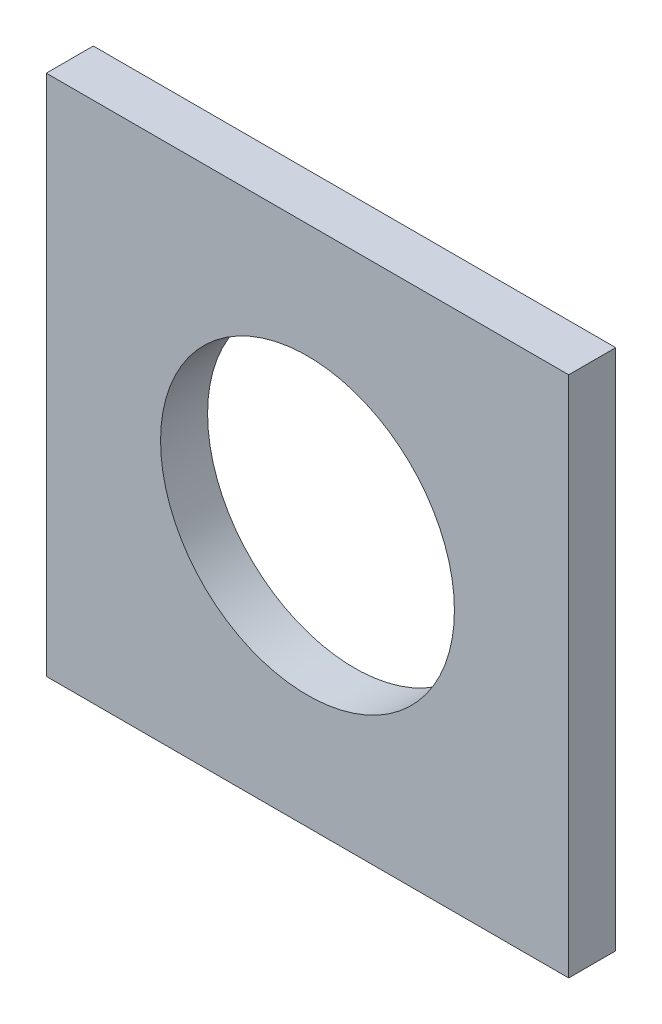
ISO-10303-21;
HEADER;
FILE_DESCRIPTION(('STEP AP214'),'2;1');
FILE_NAME('part.step','',(''),(''),'','','');
FILE_SCHEMA(('AUTOMOTIVE_DESIGN { 1 0 10303 214 1 1 1 1 }'));
ENDSEC;
DATA;
#1=APPLICATION_CONTEXT('core data for automotive mechanical design processes');
#2=APPLICATION_PROTOCOL_DEFINITION('international standard','automotive_design',2000,#1);
#3=PRODUCT_CONTEXT('',#1,'mechanical');
#4=PRODUCT('Part','Part','',(#3));
#5=PRODUCT_RELATED_PRODUCT_CATEGORY('part','',(#4));
#6=PRODUCT_DEFINITION_FORMATION('','',#4);
#7=PRODUCT_DEFINITION_CONTEXT('part definition',#1,'design');
#8=PRODUCT_DEFINITION('design','',#6,#7);
#9=PRODUCT_DEFINITION_SHAPE('','',#8);
#10=(LENGTH_UNIT() NAMED_UNIT(*) SI_UNIT(.MILLI.,.METRE.));
#11=(NAMED_UNIT(*) PLANE_ANGLE_UNIT() SI_UNIT($,.RADIAN.));
#12=(NAMED_UNIT(*) SI_UNIT($,.STERADIAN.) SOLID_ANGLE_UNIT());
#13=UNCERTAINTY_MEASURE_WITH_UNIT(LENGTH_MEASURE(1.E-05),#10,'distance_accuracy_value','');
#14=(GEOMETRIC_REPRESENTATION_CONTEXT(3) GLOBAL_UNCERTAINTY_ASSIGNED_CONTEXT((#13)) GLOBAL_UNIT_ASSIGNED_CONTEXT((#10,
#11,#12)) REPRESENTATION_CONTEXT('',''));
#15=CARTESIAN_POINT('',(0.,0.,0.));
#16=DIRECTION('',(0.,0.,1.));
#17=DIRECTION('',(1.,0.,0.));
#18=AXIS2_PLACEMENT_3D('',#15,#16,#17);
#19=CARTESIAN_POINT('',(-18.8976,19.0330666666667,4.572));
#20=DIRECTION('',(1.,0.,0.));
#21=DIRECTION('',(0.,1.,0.));
#22=AXIS2_PLACEMENT_3D('',#19,#20,#21);
#23=PLANE('',#22);
#24=DIRECTION('',(0.,-1.,0.));
#25=VECTOR('',#24,1.);
#26=CARTESIAN_POINT('',(-18.8976,19.0330666666667,0.));
#27=LINE('',#26,#25);
#28=CARTESIAN_POINT('',(-18.8976,19.0330666666667,0.));
#29=VERTEX_POINT('',#28);
#30=CARTESIAN_POINT('',(-18.8976,-31.7669333333333,0.));
#31=VERTEX_POINT('',#30);
#32=EDGE_CURVE('E96',#29,#31,#27,.T.);
#33=ORIENTED_EDGE('',*,*,#32,.T.);
#34=DIRECTION('',(0.,0.,-1.));
#35=VECTOR('',#34,1.);
#36=CARTESIAN_POINT('',(-18.8976,-31.7669333333333,4.572));
#37=LINE('',#36,#35);
#38=CARTESIAN_POINT('',(-18.8976,-31.7669333333333,4.572));
#39=VERTEX_POINT('',#38);
#40=EDGE_CURVE('E11',#39,#31,#37,.T.);
#41=ORIENTED_EDGE('',*,*,#40,.F.);
#42=DIRECTION('',(0.,-1.,0.));
#43=VECTOR('',#42,1.);
#44=CARTESIAN_POINT('',(-18.8976,19.0330666666667,4.572));
#45=LINE('',#44,#43);
#46=CARTESIAN_POINT('',(-18.8976,19.0330666666667,4.572));
#47=VERTEX_POINT('',#46);
#48=EDGE_CURVE('E84',#47,#39,#45,.T.);
#49=ORIENTED_EDGE('',*,*,#48,.F.);
#50=DIRECTION('',(0.,0.,-1.));
#51=VECTOR('',#50,1.);
#52=CARTESIAN_POINT('',(-18.8976,19.0330666666667,4.572));
#53=LINE('',#52,#51);
#54=EDGE_CURVE('E92',#47,#29,#53,.T.);
#55=ORIENTED_EDGE('',*,*,#54,.T.);
#56=EDGE_LOOP('',(#33,#41,#49,#55));
#57=FACE_BOUND('',#56,.T.);
#58=ADVANCED_FACE('F33',(#57),#23,.F.);
#59=CARTESIAN_POINT('',(-18.8976,-31.7669333333333,4.572));
#60=DIRECTION('',(0.,1.,0.));
#61=DIRECTION('',(0.,0.,1.));
#62=AXIS2_PLACEMENT_3D('',#59,#60,#61);
#63=PLANE('',#62);
#64=DIRECTION('',(1.,0.,0.));
#65=VECTOR('',#64,1.);
#66=CARTESIAN_POINT('',(-18.8976,-31.7669333333333,0.));
#67=LINE('',#66,#65);
#68=CARTESIAN_POINT('',(31.9024,-31.7669333333333,0.));
#69=VERTEX_POINT('',#68);
#70=EDGE_CURVE('E88',#31,#69,#67,.T.);
#71=ORIENTED_EDGE('',*,*,#70,.T.);
#72=DIRECTION('',(0.,0.,-1.));
#73=VECTOR('',#72,1.);
#74=CARTESIAN_POINT('',(31.9024,-31.7669333333333,4.572));
#75=LINE('',#74,#73);
#76=CARTESIAN_POINT('',(31.9024,-31.7669333333333,4.572));
#77=VERTEX_POINT('',#76);
#78=EDGE_CURVE('E41',#77,#69,#75,.T.);
#79=ORIENTED_EDGE('',*,*,#78,.F.);
#80=DIRECTION('',(1.,0.,0.));
#81=VECTOR('',#80,1.);
#82=CARTESIAN_POINT('',(-18.8976,-31.7669333333333,4.572));
#83=LINE('',#82,#81);
#84=EDGE_CURVE('E79',#39,#77,#83,.T.);
#85=ORIENTED_EDGE('',*,*,#84,.F.);
#86=ORIENTED_EDGE('',*,*,#40,.T.);
#87=EDGE_LOOP('',(#71,#79,#85,#86));
#88=FACE_BOUND('',#87,.T.);
#89=ADVANCED_FACE('F87',(#88),#63,.F.);
#90=CARTESIAN_POINT('',(31.9024,19.0330666666667,4.572));
#91=DIRECTION('',(-1.,0.,0.));
#92=DIRECTION('',(0.,0.,1.));
#93=AXIS2_PLACEMENT_3D('',#90,#91,#92);
#94=PLANE('',#93);
#95=DIRECTION('',(0.,1.,0.));
#96=VECTOR('',#95,1.);
#97=CARTESIAN_POINT('',(31.9024,19.0330666666667,0.));
#98=LINE('',#97,#96);
#99=CARTESIAN_POINT('',(31.9024,19.0330666666667,0.));
#100=VERTEX_POINT('',#99);
#101=EDGE_CURVE('E66',#69,#100,#98,.T.);
#102=ORIENTED_EDGE('',*,*,#101,.T.);
#103=DIRECTION('',(0.,0.,-1.));
#104=VECTOR('',#103,1.);
#105=CARTESIAN_POINT('',(31.9024,19.0330666666667,4.572));
#106=LINE('',#105,#104);
#107=CARTESIAN_POINT('',(31.9024,19.0330666666667,4.572));
#108=VERTEX_POINT('',#107);
#109=EDGE_CURVE('E89',#108,#100,#106,.T.);
#110=ORIENTED_EDGE('',*,*,#109,.F.);
#111=DIRECTION('',(0.,1.,0.));
#112=VECTOR('',#111,1.);
#113=CARTESIAN_POINT('',(31.9024,19.0330666666667,4.572));
#114=LINE('',#113,#112);
#115=EDGE_CURVE('E82',#77,#108,#114,.T.);
#116=ORIENTED_EDGE('',*,*,#115,.F.);
#117=ORIENTED_EDGE('',*,*,#78,.T.);
#118=EDGE_LOOP('',(#102,#110,#116,#117));
#119=FACE_BOUND('',#118,.T.);
#120=ADVANCED_FACE('F90',(#119),#94,.F.);
#121=CARTESIAN_POINT('',(-18.8976,19.0330666666667,4.572));
#122=DIRECTION('',(0.,-1.,0.));
#123=DIRECTION('',(0.,0.,-1.));
#124=AXIS2_PLACEMENT_3D('',#121,#122,#123);
#125=PLANE('',#124);
#126=DIRECTION('',(-1.,0.,0.));
#127=VECTOR('',#126,1.);
#128=CARTESIAN_POINT('',(-18.8976,19.0330666666667,0.));
#129=LINE('',#128,#127);
#130=EDGE_CURVE('E72',#100,#29,#129,.T.);
#131=ORIENTED_EDGE('',*,*,#130,.T.);
#132=ORIENTED_EDGE('',*,*,#54,.F.);
#133=DIRECTION('',(-1.,0.,0.));
#134=VECTOR('',#133,1.);
#135=CARTESIAN_POINT('',(-18.8976,19.0330666666667,4.572));
#136=LINE('',#135,#134);
#137=EDGE_CURVE('E49',#108,#47,#136,.T.);
#138=ORIENTED_EDGE('',*,*,#137,.F.);
#139=ORIENTED_EDGE('',*,*,#109,.T.);
#140=EDGE_LOOP('',(#131,#132,#138,#139));
#141=FACE_BOUND('',#140,.T.);
#142=ADVANCED_FACE('F104',(#141),#125,.F.);
#143=CARTESIAN_POINT('',(0.,0.,4.572));
#144=DIRECTION('',(0.,0.,1.));
#145=DIRECTION('',(1.,0.,0.));
#146=AXIS2_PLACEMENT_3D('',#143,#144,#145);
#147=PLANE('',#146);
#148=CARTESIAN_POINT('',(6.50239999999999,-6.36693333333333,4.572));
#149=DIRECTION('',(0.,0.,-1.));
#150=DIRECTION('',(-1.,0.,0.));
#151=AXIS2_PLACEMENT_3D('',#148,#149,#150);
#152=CIRCLE('',#151,14.2875);
#153=CARTESIAN_POINT('',(-7.78510000000001,-6.36693333333333,4.572));
#154=VERTEX_POINT('',#153);
#155=EDGE_CURVE('E99',#154,#154,#152,.T.);
#156=ORIENTED_EDGE('',*,*,#155,.T.);
#157=EDGE_LOOP('',(#156));
#158=FACE_BOUND('',#157,.T.);
#159=ORIENTED_EDGE('',*,*,#48,.T.);
#160=ORIENTED_EDGE('',*,*,#84,.T.);
#161=ORIENTED_EDGE('',*,*,#115,.T.);
#162=ORIENTED_EDGE('',*,*,#137,.T.);
#163=EDGE_LOOP('',(#159,#160,#161,#162));
#164=FACE_BOUND('',#163,.T.);
#165=ADVANCED_FACE('F80',(#158,#164),#147,.T.);
#166=CARTESIAN_POINT('',(0.,0.,0.));
#167=DIRECTION('',(0.,0.,1.));
#168=DIRECTION('',(1.,0.,0.));
#169=AXIS2_PLACEMENT_3D('',#166,#167,#168);
#170=PLANE('',#169);
#171=CARTESIAN_POINT('',(6.50239999999999,-6.36693333333333,0.));
#172=DIRECTION('',(0.,0.,-1.));
#173=DIRECTION('',(-1.,0.,0.));
#174=AXIS2_PLACEMENT_3D('',#171,#172,#173);
#175=CIRCLE('',#174,14.2875);
#176=CARTESIAN_POINT('',(-7.78510000000001,-6.36693333333333,0.));
#177=VERTEX_POINT('',#176);
#178=EDGE_CURVE('E110',#177,#177,#175,.T.);
#179=ORIENTED_EDGE('',*,*,#178,.F.);
#180=EDGE_LOOP('',(#179));
#181=FACE_BOUND('',#180,.T.);
#182=ORIENTED_EDGE('',*,*,#32,.F.);
#183=ORIENTED_EDGE('',*,*,#130,.F.);
#184=ORIENTED_EDGE('',*,*,#101,.F.);
#185=ORIENTED_EDGE('',*,*,#70,.F.);
#186=EDGE_LOOP('',(#182,#183,#184,#185));
#187=FACE_BOUND('',#186,.T.);
#188=ADVANCED_FACE('F107',(#181,#187),#170,.F.);
#189=CARTESIAN_POINT('',(6.50239999999999,-6.36693333333333,4.572));
#190=DIRECTION('',(0.,0.,-1.));
#191=DIRECTION('',(-1.,0.,0.));
#192=AXIS2_PLACEMENT_3D('',#189,#190,#191);
#193=CYLINDRICAL_SURFACE('',#192,14.2875);
#194=ORIENTED_EDGE('',*,*,#155,.F.);
#195=EDGE_LOOP('',(#194));
#196=FACE_BOUND('',#195,.T.);
#197=ORIENTED_EDGE('',*,*,#178,.T.);
#198=EDGE_LOOP('',(#197));
#199=FACE_BOUND('',#198,.T.);
#200=ADVANCED_FACE('F117',(#196,#199),#193,.F.);
#201=CLOSED_SHELL('',(#58,#89,#120,#142,#165,#188,#200));
#202=MANIFOLD_SOLID_BREP('B2',#201);
#203=ADVANCED_BREP_SHAPE_REPRESENTATION('',(#18,#202),#14);
#204=SHAPE_DEFINITION_REPRESENTATION(#9,#203);
ENDSEC;
END-ISO-10303-21;
